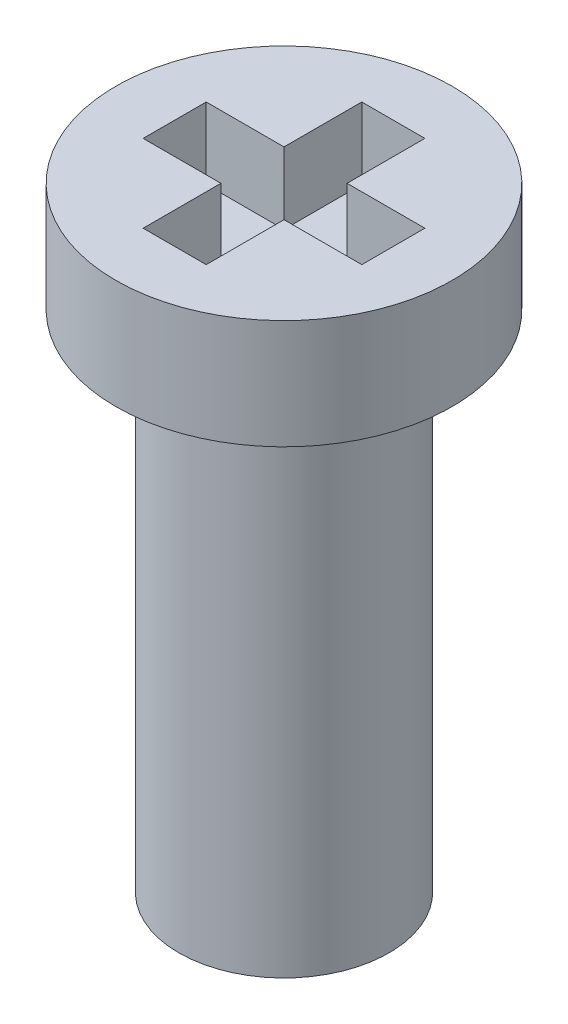
ISO-10303-21;
HEADER;
FILE_DESCRIPTION(('STEP AP214'),'2;1');
FILE_NAME('part.step','',(''),(''),'','','');
FILE_SCHEMA(('AUTOMOTIVE_DESIGN { 1 0 10303 214 1 1 1 1 }'));
ENDSEC;
DATA;
#1=APPLICATION_CONTEXT('core data for automotive mechanical design processes');
#2=APPLICATION_PROTOCOL_DEFINITION('international standard','automotive_design',2000,#1);
#3=PRODUCT_CONTEXT('',#1,'mechanical');
#4=PRODUCT('Part','Part','',(#3));
#5=PRODUCT_RELATED_PRODUCT_CATEGORY('part','',(#4));
#6=PRODUCT_DEFINITION_FORMATION('','',#4);
#7=PRODUCT_DEFINITION_CONTEXT('part definition',#1,'design');
#8=PRODUCT_DEFINITION('design','',#6,#7);
#9=PRODUCT_DEFINITION_SHAPE('','',#8);
#10=(LENGTH_UNIT() NAMED_UNIT(*) SI_UNIT(.MILLI.,.METRE.));
#11=(NAMED_UNIT(*) PLANE_ANGLE_UNIT() SI_UNIT($,.RADIAN.));
#12=(NAMED_UNIT(*) SI_UNIT($,.STERADIAN.) SOLID_ANGLE_UNIT());
#13=UNCERTAINTY_MEASURE_WITH_UNIT(LENGTH_MEASURE(1.E-05),#10,'distance_accuracy_value','');
#14=(GEOMETRIC_REPRESENTATION_CONTEXT(3) GLOBAL_UNCERTAINTY_ASSIGNED_CONTEXT((#13)) GLOBAL_UNIT_ASSIGNED_CONTEXT((#10,
#11,#12)) REPRESENTATION_CONTEXT('',''));
#15=CARTESIAN_POINT('',(0.,0.,0.));
#16=DIRECTION('',(0.,0.,1.));
#17=DIRECTION('',(1.,0.,0.));
#18=AXIS2_PLACEMENT_3D('',#15,#16,#17);
#19=CARTESIAN_POINT('',(0.,7.3,0.));
#20=DIRECTION('',(0.,1.,0.));
#21=DIRECTION('',(0.,0.,1.));
#22=AXIS2_PLACEMENT_3D('',#19,#20,#21);
#23=PLANE('',#22);
#24=DIRECTION('',(-1.,0.,0.));
#25=VECTOR('',#24,1.);
#26=CARTESIAN_POINT('',(0.375,7.3,-1.3));
#27=LINE('',#26,#25);
#28=CARTESIAN_POINT('',(0.375,7.3,-1.3));
#29=VERTEX_POINT('',#28);
#30=CARTESIAN_POINT('',(-0.375,7.3,-1.3));
#31=VERTEX_POINT('',#30);
#32=EDGE_CURVE('E54',#29,#31,#27,.T.);
#33=ORIENTED_EDGE('',*,*,#32,.F.);
#34=DIRECTION('',(0.,0.,-1.));
#35=VECTOR('',#34,1.);
#36=CARTESIAN_POINT('',(0.375,7.3,-1.3));
#37=LINE('',#36,#35);
#38=CARTESIAN_POINT('',(0.375,7.3,-0.374999999999999));
#39=VERTEX_POINT('',#38);
#40=EDGE_CURVE('E207',#39,#29,#37,.T.);
#41=ORIENTED_EDGE('',*,*,#40,.F.);
#42=DIRECTION('',(-1.,0.,0.));
#43=VECTOR('',#42,1.);
#44=CARTESIAN_POINT('',(1.3,7.3,-0.375));
#45=LINE('',#44,#43);
#46=CARTESIAN_POINT('',(1.3,7.3,-0.375));
#47=VERTEX_POINT('',#46);
#48=EDGE_CURVE('E204',#47,#39,#45,.T.);
#49=ORIENTED_EDGE('',*,*,#48,.F.);
#50=DIRECTION('',(0.,0.,-1.));
#51=VECTOR('',#50,1.);
#52=CARTESIAN_POINT('',(1.3,7.3,0.375));
#53=LINE('',#52,#51);
#54=CARTESIAN_POINT('',(1.3,7.3,0.375));
#55=VERTEX_POINT('',#54);
#56=EDGE_CURVE('E138',#55,#47,#53,.T.);
#57=ORIENTED_EDGE('',*,*,#56,.F.);
#58=DIRECTION('',(1.,0.,0.));
#59=VECTOR('',#58,1.);
#60=CARTESIAN_POINT('',(1.3,7.3,0.375));
#61=LINE('',#60,#59);
#62=CARTESIAN_POINT('',(0.375,7.3,0.374999999999999));
#63=VERTEX_POINT('',#62);
#64=EDGE_CURVE('E198',#63,#55,#61,.T.);
#65=ORIENTED_EDGE('',*,*,#64,.F.);
#66=DIRECTION('',(0.,0.,-1.));
#67=VECTOR('',#66,1.);
#68=CARTESIAN_POINT('',(0.375,7.3,0.374999999999999));
#69=LINE('',#68,#67);
#70=CARTESIAN_POINT('',(0.375,7.3,1.3));
#71=VERTEX_POINT('',#70);
#72=EDGE_CURVE('E194',#71,#63,#69,.T.);
#73=ORIENTED_EDGE('',*,*,#72,.F.);
#74=DIRECTION('',(1.,0.,0.));
#75=VECTOR('',#74,1.);
#76=CARTESIAN_POINT('',(0.375,7.3,1.3));
#77=LINE('',#76,#75);
#78=CARTESIAN_POINT('',(-0.375,7.3,1.3));
#79=VERTEX_POINT('',#78);
#80=EDGE_CURVE('E190',#79,#71,#77,.T.);
#81=ORIENTED_EDGE('',*,*,#80,.F.);
#82=DIRECTION('',(0.,0.,1.));
#83=VECTOR('',#82,1.);
#84=CARTESIAN_POINT('',(-0.375,7.3,0.375));
#85=LINE('',#84,#83);
#86=CARTESIAN_POINT('',(-0.375,7.3,0.375));
#87=VERTEX_POINT('',#86);
#88=EDGE_CURVE('E186',#87,#79,#85,.T.);
#89=ORIENTED_EDGE('',*,*,#88,.F.);
#90=DIRECTION('',(1.,0.,0.));
#91=VECTOR('',#90,1.);
#92=CARTESIAN_POINT('',(-0.375,7.3,0.375));
#93=LINE('',#92,#91);
#94=CARTESIAN_POINT('',(-1.3,7.3,0.375));
#95=VERTEX_POINT('',#94);
#96=EDGE_CURVE('E182',#95,#87,#93,.T.);
#97=ORIENTED_EDGE('',*,*,#96,.F.);
#98=DIRECTION('',(0.,0.,1.));
#99=VECTOR('',#98,1.);
#100=CARTESIAN_POINT('',(-1.3,7.3,0.375));
#101=LINE('',#100,#99);
#102=CARTESIAN_POINT('',(-1.3,7.3,-0.374999999999999));
#103=VERTEX_POINT('',#102);
#104=EDGE_CURVE('E178',#103,#95,#101,.T.);
#105=ORIENTED_EDGE('',*,*,#104,.F.);
#106=DIRECTION('',(-1.,0.,0.));
#107=VECTOR('',#106,1.);
#108=CARTESIAN_POINT('',(-0.375,7.3,-0.374999999999999));
#109=LINE('',#108,#107);
#110=CARTESIAN_POINT('',(-0.375,7.3,-0.374999999999999));
#111=VERTEX_POINT('',#110);
#112=EDGE_CURVE('E174',#111,#103,#109,.T.);
#113=ORIENTED_EDGE('',*,*,#112,.F.);
#114=DIRECTION('',(0.,0.,1.));
#115=VECTOR('',#114,1.);
#116=CARTESIAN_POINT('',(-0.375,7.3,-1.3));
#117=LINE('',#116,#115);
#118=EDGE_CURVE('E170',#31,#111,#117,.T.);
#119=ORIENTED_EDGE('',*,*,#118,.F.);
#120=EDGE_LOOP('',(#33,#41,#49,#57,#65,#73,#81,#89,#97,#105,#113,#119));
#121=FACE_BOUND('',#120,.T.);
#122=CARTESIAN_POINT('',(0.,7.3,0.));
#123=DIRECTION('',(0.,-1.,0.));
#124=DIRECTION('',(0.,0.,-1.));
#125=AXIS2_PLACEMENT_3D('',#122,#123,#124);
#126=CIRCLE('',#125,2.);
#127=CARTESIAN_POINT('',(0.,7.3,-2.));
#128=VERTEX_POINT('',#127);
#129=EDGE_CURVE('E11',#128,#128,#126,.T.);
#130=ORIENTED_EDGE('',*,*,#129,.F.);
#131=EDGE_LOOP('',(#130));
#132=FACE_BOUND('',#131,.T.);
#133=ADVANCED_FACE('F39',(#121,#132),#23,.T.);
#134=CARTESIAN_POINT('',(0.,0.,0.));
#135=DIRECTION('',(0.,-1.,0.));
#136=DIRECTION('',(0.,0.,-1.));
#137=AXIS2_PLACEMENT_3D('',#134,#135,#136);
#138=CYLINDRICAL_SURFACE('',#137,2.);
#139=ORIENTED_EDGE('',*,*,#129,.T.);
#140=EDGE_LOOP('',(#139));
#141=FACE_BOUND('',#140,.T.);
#142=CARTESIAN_POINT('',(0.,6.,0.));
#143=DIRECTION('',(0.,-1.,0.));
#144=DIRECTION('',(0.,0.,-1.));
#145=AXIS2_PLACEMENT_3D('',#142,#143,#144);
#146=CIRCLE('',#145,2.);
#147=CARTESIAN_POINT('',(0.,6.,-2.));
#148=VERTEX_POINT('',#147);
#149=EDGE_CURVE('E47',#148,#148,#146,.T.);
#150=ORIENTED_EDGE('',*,*,#149,.F.);
#151=EDGE_LOOP('',(#150));
#152=FACE_BOUND('',#151,.T.);
#153=ADVANCED_FACE('F254',(#141,#152),#138,.T.);
#154=CARTESIAN_POINT('',(0.,6.,-2.));
#155=DIRECTION('',(0.,-1.,0.));
#156=DIRECTION('',(0.,0.,-1.));
#157=AXIS2_PLACEMENT_3D('',#154,#155,#156);
#158=PLANE('',#157);
#159=ORIENTED_EDGE('',*,*,#149,.T.);
#160=EDGE_LOOP('',(#159));
#161=FACE_BOUND('',#160,.T.);
#162=CARTESIAN_POINT('',(0.,6.,0.));
#163=DIRECTION('',(0.,-1.,0.));
#164=DIRECTION('',(0.,0.,-1.));
#165=AXIS2_PLACEMENT_3D('',#162,#163,#164);
#166=CIRCLE('',#165,1.25);
#167=CARTESIAN_POINT('',(0.,6.,-1.25));
#168=VERTEX_POINT('',#167);
#169=EDGE_CURVE('E244',#168,#168,#166,.T.);
#170=ORIENTED_EDGE('',*,*,#169,.F.);
#171=EDGE_LOOP('',(#170));
#172=FACE_BOUND('',#171,.T.);
#173=ADVANCED_FACE('F251',(#161,#172),#158,.T.);
#174=CARTESIAN_POINT('',(0.,0.,0.));
#175=DIRECTION('',(0.,-1.,0.));
#176=DIRECTION('',(0.,0.,-1.));
#177=AXIS2_PLACEMENT_3D('',#174,#175,#176);
#178=CYLINDRICAL_SURFACE('',#177,1.25);
#179=ORIENTED_EDGE('',*,*,#169,.T.);
#180=EDGE_LOOP('',(#179));
#181=FACE_BOUND('',#180,.T.);
#182=CARTESIAN_POINT('',(0.,0.,0.));
#183=DIRECTION('',(0.,-1.,0.));
#184=DIRECTION('',(0.,0.,-1.));
#185=AXIS2_PLACEMENT_3D('',#182,#183,#184);
#186=CIRCLE('',#185,1.25);
#187=CARTESIAN_POINT('',(0.,0.,-1.25));
#188=VERTEX_POINT('',#187);
#189=EDGE_CURVE('E213',#188,#188,#186,.T.);
#190=ORIENTED_EDGE('',*,*,#189,.F.);
#191=EDGE_LOOP('',(#190));
#192=FACE_BOUND('',#191,.T.);
#193=ADVANCED_FACE('F261',(#181,#192),#178,.T.);
#194=CARTESIAN_POINT('',(0.,0.,-1.25));
#195=DIRECTION('',(0.,-1.,0.));
#196=DIRECTION('',(0.,0.,-1.));
#197=AXIS2_PLACEMENT_3D('',#194,#195,#196);
#198=PLANE('',#197);
#199=ORIENTED_EDGE('',*,*,#189,.T.);
#200=EDGE_LOOP('',(#199));
#201=FACE_BOUND('',#200,.T.);
#202=ADVANCED_FACE('F267',(#201),#198,.T.);
#203=CARTESIAN_POINT('',(0.375,6.45,-1.3));
#204=DIRECTION('',(0.,0.,-1.));
#205=DIRECTION('',(-1.,0.,0.));
#206=AXIS2_PLACEMENT_3D('',#203,#204,#205);
#207=PLANE('',#206);
#208=ORIENTED_EDGE('',*,*,#32,.T.);
#209=DIRECTION('',(0.,1.,0.));
#210=VECTOR('',#209,1.);
#211=CARTESIAN_POINT('',(-0.375,6.45,-1.3));
#212=LINE('',#211,#210);
#213=CARTESIAN_POINT('',(-0.375,6.45,-1.3));
#214=VERTEX_POINT('',#213);
#215=EDGE_CURVE('E102',#214,#31,#212,.T.);
#216=ORIENTED_EDGE('',*,*,#215,.F.);
#217=DIRECTION('',(-1.,0.,0.));
#218=VECTOR('',#217,1.);
#219=CARTESIAN_POINT('',(0.375,6.45,-1.3));
#220=LINE('',#219,#218);
#221=CARTESIAN_POINT('',(0.375,6.45,-1.3));
#222=VERTEX_POINT('',#221);
#223=EDGE_CURVE('E210',#222,#214,#220,.T.);
#224=ORIENTED_EDGE('',*,*,#223,.F.);
#225=DIRECTION('',(0.,1.,0.));
#226=VECTOR('',#225,1.);
#227=CARTESIAN_POINT('',(0.375,6.45,-1.3));
#228=LINE('',#227,#226);
#229=EDGE_CURVE('E62',#222,#29,#228,.T.);
#230=ORIENTED_EDGE('',*,*,#229,.T.);
#231=EDGE_LOOP('',(#208,#216,#224,#230));
#232=FACE_BOUND('',#231,.T.);
#233=ADVANCED_FACE('F271',(#232),#207,.F.);
#234=CARTESIAN_POINT('',(0.375,6.45,-1.3));
#235=DIRECTION('',(1.,0.,0.));
#236=DIRECTION('',(0.,0.,-1.));
#237=AXIS2_PLACEMENT_3D('',#234,#235,#236);
#238=PLANE('',#237);
#239=ORIENTED_EDGE('',*,*,#40,.T.);
#240=ORIENTED_EDGE('',*,*,#229,.F.);
#241=DIRECTION('',(0.,0.,-1.));
#242=VECTOR('',#241,1.);
#243=CARTESIAN_POINT('',(0.375,6.45,-1.3));
#244=LINE('',#243,#242);
#245=CARTESIAN_POINT('',(0.375,6.45,-0.374999999999999));
#246=VERTEX_POINT('',#245);
#247=EDGE_CURVE('E152',#246,#222,#244,.T.);
#248=ORIENTED_EDGE('',*,*,#247,.F.);
#249=DIRECTION('',(0.,1.,0.));
#250=VECTOR('',#249,1.);
#251=CARTESIAN_POINT('',(0.375,6.45,-0.374999999999999));
#252=LINE('',#251,#250);
#253=EDGE_CURVE('E143',#246,#39,#252,.T.);
#254=ORIENTED_EDGE('',*,*,#253,.T.);
#255=EDGE_LOOP('',(#239,#240,#248,#254));
#256=FACE_BOUND('',#255,.T.);
#257=ADVANCED_FACE('F275',(#256),#238,.F.);
#258=CARTESIAN_POINT('',(1.3,6.45,-0.375));
#259=DIRECTION('',(0.,0.,-1.));
#260=DIRECTION('',(-1.,0.,0.));
#261=AXIS2_PLACEMENT_3D('',#258,#259,#260);
#262=PLANE('',#261);
#263=ORIENTED_EDGE('',*,*,#48,.T.);
#264=ORIENTED_EDGE('',*,*,#253,.F.);
#265=DIRECTION('',(-1.,0.,0.));
#266=VECTOR('',#265,1.);
#267=CARTESIAN_POINT('',(1.3,6.45,-0.375));
#268=LINE('',#267,#266);
#269=CARTESIAN_POINT('',(1.3,6.45,-0.375));
#270=VERTEX_POINT('',#269);
#271=EDGE_CURVE('E147',#270,#246,#268,.T.);
#272=ORIENTED_EDGE('',*,*,#271,.F.);
#273=DIRECTION('',(0.,1.,0.));
#274=VECTOR('',#273,1.);
#275=CARTESIAN_POINT('',(1.3,6.45,-0.375));
#276=LINE('',#275,#274);
#277=EDGE_CURVE('E131',#270,#47,#276,.T.);
#278=ORIENTED_EDGE('',*,*,#277,.T.);
#279=EDGE_LOOP('',(#263,#264,#272,#278));
#280=FACE_BOUND('',#279,.T.);
#281=ADVANCED_FACE('F148',(#280),#262,.F.);
#282=CARTESIAN_POINT('',(1.3,6.45,0.375));
#283=DIRECTION('',(1.,0.,0.));
#284=DIRECTION('',(0.,0.,-1.));
#285=AXIS2_PLACEMENT_3D('',#282,#283,#284);
#286=PLANE('',#285);
#287=ORIENTED_EDGE('',*,*,#56,.T.);
#288=ORIENTED_EDGE('',*,*,#277,.F.);
#289=DIRECTION('',(0.,0.,-1.));
#290=VECTOR('',#289,1.);
#291=CARTESIAN_POINT('',(1.3,6.45,0.375));
#292=LINE('',#291,#290);
#293=CARTESIAN_POINT('',(1.3,6.45,0.375));
#294=VERTEX_POINT('',#293);
#295=EDGE_CURVE('E135',#294,#270,#292,.T.);
#296=ORIENTED_EDGE('',*,*,#295,.F.);
#297=DIRECTION('',(0.,1.,0.));
#298=VECTOR('',#297,1.);
#299=CARTESIAN_POINT('',(1.3,6.45,0.375));
#300=LINE('',#299,#298);
#301=EDGE_CURVE('E144',#294,#55,#300,.T.);
#302=ORIENTED_EDGE('',*,*,#301,.T.);
#303=EDGE_LOOP('',(#287,#288,#296,#302));
#304=FACE_BOUND('',#303,.T.);
#305=ADVANCED_FACE('F133',(#304),#286,.F.);
#306=CARTESIAN_POINT('',(1.3,6.45,0.375));
#307=DIRECTION('',(0.,0.,1.));
#308=DIRECTION('',(1.,0.,0.));
#309=AXIS2_PLACEMENT_3D('',#306,#307,#308);
#310=PLANE('',#309);
#311=ORIENTED_EDGE('',*,*,#64,.T.);
#312=ORIENTED_EDGE('',*,*,#301,.F.);
#313=DIRECTION('',(1.,0.,0.));
#314=VECTOR('',#313,1.);
#315=CARTESIAN_POINT('',(1.3,6.45,0.375));
#316=LINE('',#315,#314);
#317=CARTESIAN_POINT('',(0.375,6.45,0.374999999999999));
#318=VERTEX_POINT('',#317);
#319=EDGE_CURVE('E158',#318,#294,#316,.T.);
#320=ORIENTED_EDGE('',*,*,#319,.F.);
#321=DIRECTION('',(0.,1.,0.));
#322=VECTOR('',#321,1.);
#323=CARTESIAN_POINT('',(0.375,6.45,0.374999999999999));
#324=LINE('',#323,#322);
#325=EDGE_CURVE('E218',#318,#63,#324,.T.);
#326=ORIENTED_EDGE('',*,*,#325,.T.);
#327=EDGE_LOOP('',(#311,#312,#320,#326));
#328=FACE_BOUND('',#327,.T.);
#329=ADVANCED_FACE('F303',(#328),#310,.F.);
#330=CARTESIAN_POINT('',(0.375,6.45,0.374999999999999));
#331=DIRECTION('',(1.,0.,0.));
#332=DIRECTION('',(0.,0.,-1.));
#333=AXIS2_PLACEMENT_3D('',#330,#331,#332);
#334=PLANE('',#333);
#335=ORIENTED_EDGE('',*,*,#72,.T.);
#336=ORIENTED_EDGE('',*,*,#325,.F.);
#337=DIRECTION('',(0.,0.,-1.));
#338=VECTOR('',#337,1.);
#339=CARTESIAN_POINT('',(0.375,6.45,0.374999999999999));
#340=LINE('',#339,#338);
#341=CARTESIAN_POINT('',(0.375,6.45,1.3));
#342=VERTEX_POINT('',#341);
#343=EDGE_CURVE('E162',#342,#318,#340,.T.);
#344=ORIENTED_EDGE('',*,*,#343,.F.);
#345=DIRECTION('',(0.,1.,0.));
#346=VECTOR('',#345,1.);
#347=CARTESIAN_POINT('',(0.375,6.45,1.3));
#348=LINE('',#347,#346);
#349=EDGE_CURVE('E221',#342,#71,#348,.T.);
#350=ORIENTED_EDGE('',*,*,#349,.T.);
#351=EDGE_LOOP('',(#335,#336,#344,#350));
#352=FACE_BOUND('',#351,.T.);
#353=ADVANCED_FACE('F299',(#352),#334,.F.);
#354=CARTESIAN_POINT('',(0.375,6.45,1.3));
#355=DIRECTION('',(0.,0.,1.));
#356=DIRECTION('',(1.,0.,0.));
#357=AXIS2_PLACEMENT_3D('',#354,#355,#356);
#358=PLANE('',#357);
#359=ORIENTED_EDGE('',*,*,#80,.T.);
#360=ORIENTED_EDGE('',*,*,#349,.F.);
#361=DIRECTION('',(1.,0.,0.));
#362=VECTOR('',#361,1.);
#363=CARTESIAN_POINT('',(0.375,6.45,1.3));
#364=LINE('',#363,#362);
#365=CARTESIAN_POINT('',(-0.375,6.45,1.3));
#366=VERTEX_POINT('',#365);
#367=EDGE_CURVE('E450',#366,#342,#364,.T.);
#368=ORIENTED_EDGE('',*,*,#367,.F.);
#369=DIRECTION('',(0.,1.,0.));
#370=VECTOR('',#369,1.);
#371=CARTESIAN_POINT('',(-0.375,6.45,1.3));
#372=LINE('',#371,#370);
#373=EDGE_CURVE('E224',#366,#79,#372,.T.);
#374=ORIENTED_EDGE('',*,*,#373,.T.);
#375=EDGE_LOOP('',(#359,#360,#368,#374));
#376=FACE_BOUND('',#375,.T.);
#377=ADVANCED_FACE('F295',(#376),#358,.F.);
#378=CARTESIAN_POINT('',(-0.375,6.45,0.375));
#379=DIRECTION('',(-1.,0.,0.));
#380=DIRECTION('',(0.,0.,1.));
#381=AXIS2_PLACEMENT_3D('',#378,#379,#380);
#382=PLANE('',#381);
#383=ORIENTED_EDGE('',*,*,#88,.T.);
#384=ORIENTED_EDGE('',*,*,#373,.F.);
#385=DIRECTION('',(0.,0.,1.));
#386=VECTOR('',#385,1.);
#387=CARTESIAN_POINT('',(-0.375,6.45,0.375));
#388=LINE('',#387,#386);
#389=CARTESIAN_POINT('',(-0.375,6.45,0.375));
#390=VERTEX_POINT('',#389);
#391=EDGE_CURVE('E446',#390,#366,#388,.T.);
#392=ORIENTED_EDGE('',*,*,#391,.F.);
#393=DIRECTION('',(0.,1.,0.));
#394=VECTOR('',#393,1.);
#395=CARTESIAN_POINT('',(-0.375,6.45,0.375));
#396=LINE('',#395,#394);
#397=EDGE_CURVE('E227',#390,#87,#396,.T.);
#398=ORIENTED_EDGE('',*,*,#397,.T.);
#399=EDGE_LOOP('',(#383,#384,#392,#398));
#400=FACE_BOUND('',#399,.T.);
#401=ADVANCED_FACE('F291',(#400),#382,.F.);
#402=CARTESIAN_POINT('',(-0.375,6.45,0.375));
#403=DIRECTION('',(0.,0.,1.));
#404=DIRECTION('',(1.,0.,0.));
#405=AXIS2_PLACEMENT_3D('',#402,#403,#404);
#406=PLANE('',#405);
#407=ORIENTED_EDGE('',*,*,#96,.T.);
#408=ORIENTED_EDGE('',*,*,#397,.F.);
#409=DIRECTION('',(1.,0.,0.));
#410=VECTOR('',#409,1.);
#411=CARTESIAN_POINT('',(-0.375,6.45,0.375));
#412=LINE('',#411,#410);
#413=CARTESIAN_POINT('',(-1.3,6.45,0.375));
#414=VERTEX_POINT('',#413);
#415=EDGE_CURVE('E442',#414,#390,#412,.T.);
#416=ORIENTED_EDGE('',*,*,#415,.F.);
#417=DIRECTION('',(0.,1.,0.));
#418=VECTOR('',#417,1.);
#419=CARTESIAN_POINT('',(-1.3,6.45,0.375));
#420=LINE('',#419,#418);
#421=EDGE_CURVE('E230',#414,#95,#420,.T.);
#422=ORIENTED_EDGE('',*,*,#421,.T.);
#423=EDGE_LOOP('',(#407,#408,#416,#422));
#424=FACE_BOUND('',#423,.T.);
#425=ADVANCED_FACE('F287',(#424),#406,.F.);
#426=CARTESIAN_POINT('',(-1.3,6.45,0.375));
#427=DIRECTION('',(-1.,0.,0.));
#428=DIRECTION('',(0.,0.,1.));
#429=AXIS2_PLACEMENT_3D('',#426,#427,#428);
#430=PLANE('',#429);
#431=ORIENTED_EDGE('',*,*,#104,.T.);
#432=ORIENTED_EDGE('',*,*,#421,.F.);
#433=DIRECTION('',(0.,0.,1.));
#434=VECTOR('',#433,1.);
#435=CARTESIAN_POINT('',(-1.3,6.45,0.375));
#436=LINE('',#435,#434);
#437=CARTESIAN_POINT('',(-1.3,6.45,-0.374999999999999));
#438=VERTEX_POINT('',#437);
#439=EDGE_CURVE('E438',#438,#414,#436,.T.);
#440=ORIENTED_EDGE('',*,*,#439,.F.);
#441=DIRECTION('',(0.,1.,0.));
#442=VECTOR('',#441,1.);
#443=CARTESIAN_POINT('',(-1.3,6.45,-0.374999999999999));
#444=LINE('',#443,#442);
#445=EDGE_CURVE('E233',#438,#103,#444,.T.);
#446=ORIENTED_EDGE('',*,*,#445,.T.);
#447=EDGE_LOOP('',(#431,#432,#440,#446));
#448=FACE_BOUND('',#447,.T.);
#449=ADVANCED_FACE('F283',(#448),#430,.F.);
#450=CARTESIAN_POINT('',(-0.375,6.45,-0.374999999999999));
#451=DIRECTION('',(0.,0.,-1.));
#452=DIRECTION('',(-1.,0.,0.));
#453=AXIS2_PLACEMENT_3D('',#450,#451,#452);
#454=PLANE('',#453);
#455=ORIENTED_EDGE('',*,*,#112,.T.);
#456=ORIENTED_EDGE('',*,*,#445,.F.);
#457=DIRECTION('',(-1.,0.,0.));
#458=VECTOR('',#457,1.);
#459=CARTESIAN_POINT('',(-0.375,6.45,-0.374999999999999));
#460=LINE('',#459,#458);
#461=CARTESIAN_POINT('',(-0.375,6.45,-0.374999999999999));
#462=VERTEX_POINT('',#461);
#463=EDGE_CURVE('E431',#462,#438,#460,.T.);
#464=ORIENTED_EDGE('',*,*,#463,.F.);
#465=DIRECTION('',(0.,1.,0.));
#466=VECTOR('',#465,1.);
#467=CARTESIAN_POINT('',(-0.375,6.45,-0.374999999999999));
#468=LINE('',#467,#466);
#469=EDGE_CURVE('E236',#462,#111,#468,.T.);
#470=ORIENTED_EDGE('',*,*,#469,.T.);
#471=EDGE_LOOP('',(#455,#456,#464,#470));
#472=FACE_BOUND('',#471,.T.);
#473=ADVANCED_FACE('F279',(#472),#454,.F.);
#474=CARTESIAN_POINT('',(-0.375,6.45,-1.3));
#475=DIRECTION('',(-1.,0.,0.));
#476=DIRECTION('',(0.,0.,1.));
#477=AXIS2_PLACEMENT_3D('',#474,#475,#476);
#478=PLANE('',#477);
#479=ORIENTED_EDGE('',*,*,#118,.T.);
#480=ORIENTED_EDGE('',*,*,#469,.F.);
#481=DIRECTION('',(0.,0.,1.));
#482=VECTOR('',#481,1.);
#483=CARTESIAN_POINT('',(-0.375,6.45,-1.3));
#484=LINE('',#483,#482);
#485=EDGE_CURVE('E428',#214,#462,#484,.T.);
#486=ORIENTED_EDGE('',*,*,#485,.F.);
#487=ORIENTED_EDGE('',*,*,#215,.T.);
#488=EDGE_LOOP('',(#479,#480,#486,#487));
#489=FACE_BOUND('',#488,.T.);
#490=ADVANCED_FACE('F276',(#489),#478,.F.);
#491=CARTESIAN_POINT('',(0.,6.45,0.));
#492=DIRECTION('',(0.,1.,0.));
#493=DIRECTION('',(0.,0.,1.));
#494=AXIS2_PLACEMENT_3D('',#491,#492,#493);
#495=PLANE('',#494);
#496=ORIENTED_EDGE('',*,*,#223,.T.);
#497=ORIENTED_EDGE('',*,*,#485,.T.);
#498=ORIENTED_EDGE('',*,*,#463,.T.);
#499=ORIENTED_EDGE('',*,*,#439,.T.);
#500=ORIENTED_EDGE('',*,*,#415,.T.);
#501=ORIENTED_EDGE('',*,*,#391,.T.);
#502=ORIENTED_EDGE('',*,*,#367,.T.);
#503=ORIENTED_EDGE('',*,*,#343,.T.);
#504=ORIENTED_EDGE('',*,*,#319,.T.);
#505=ORIENTED_EDGE('',*,*,#295,.T.);
#506=ORIENTED_EDGE('',*,*,#271,.T.);
#507=ORIENTED_EDGE('',*,*,#247,.T.);
#508=EDGE_LOOP('',(#496,#497,#498,#499,#500,#501,#502,#503,#504,#505,#506,#507));
#509=FACE_BOUND('',#508,.T.);
#510=ADVANCED_FACE('F155',(#509),#495,.T.);
#511=CLOSED_SHELL('',(#133,#153,#173,#193,#202,#233,#257,#281,#305,#329,#353,#377,#401,#425,
#449,#473,#490,#510));
#512=MANIFOLD_SOLID_BREP('B2',#511);
#513=ADVANCED_BREP_SHAPE_REPRESENTATION('',(#18,#512),#14);
#514=SHAPE_DEFINITION_REPRESENTATION(#9,#513);
ENDSEC;
END-ISO-10303-21;
